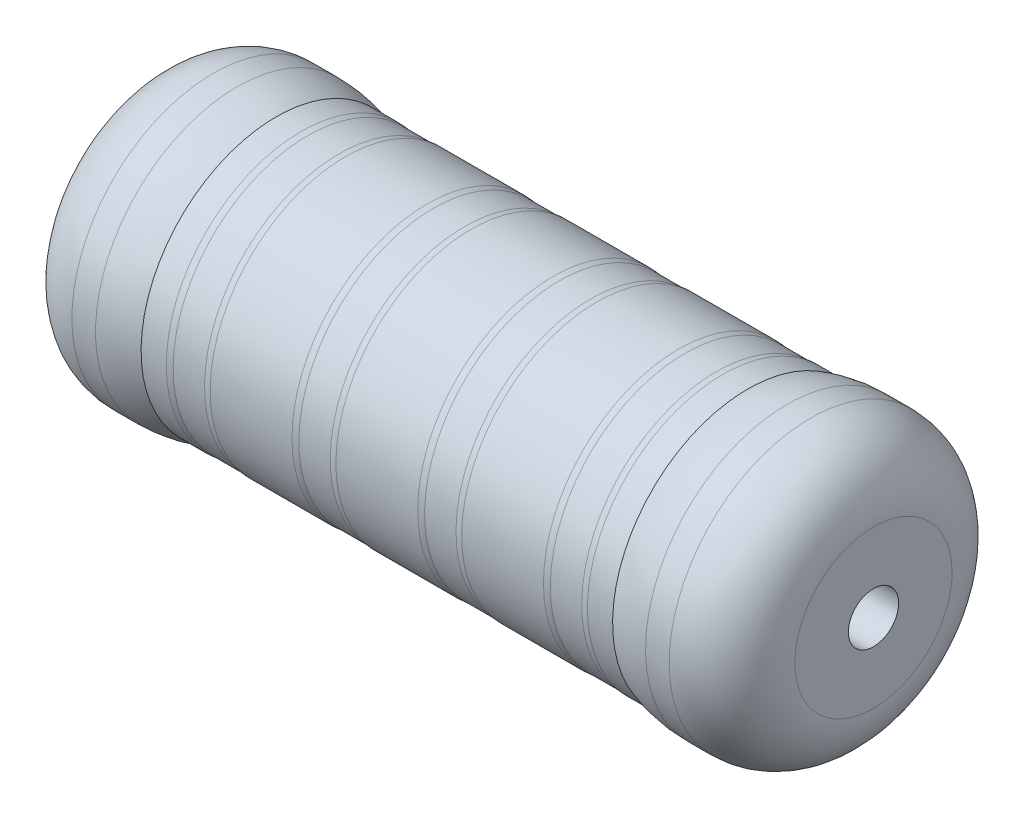
ISO-10303-21;
HEADER;
FILE_DESCRIPTION(('STEP AP214'),'2;1');
FILE_NAME('part.step','',(''),(''),'','','');
FILE_SCHEMA(('AUTOMOTIVE_DESIGN { 1 0 10303 214 1 1 1 1 }'));
ENDSEC;
DATA;
#1=APPLICATION_CONTEXT('core data for automotive mechanical design processes');
#2=APPLICATION_PROTOCOL_DEFINITION('international standard','automotive_design',2000,#1);
#3=PRODUCT_CONTEXT('',#1,'mechanical');
#4=PRODUCT('Part','Part','',(#3));
#5=PRODUCT_RELATED_PRODUCT_CATEGORY('part','',(#4));
#6=PRODUCT_DEFINITION_FORMATION('','',#4);
#7=PRODUCT_DEFINITION_CONTEXT('part definition',#1,'design');
#8=PRODUCT_DEFINITION('design','',#6,#7);
#9=PRODUCT_DEFINITION_SHAPE('','',#8);
#10=(LENGTH_UNIT() NAMED_UNIT(*) SI_UNIT(.MILLI.,.METRE.));
#11=(NAMED_UNIT(*) PLANE_ANGLE_UNIT() SI_UNIT($,.RADIAN.));
#12=(NAMED_UNIT(*) SI_UNIT($,.STERADIAN.) SOLID_ANGLE_UNIT());
#13=UNCERTAINTY_MEASURE_WITH_UNIT(LENGTH_MEASURE(1.E-05),#10,'distance_accuracy_value','');
#14=(GEOMETRIC_REPRESENTATION_CONTEXT(3) GLOBAL_UNCERTAINTY_ASSIGNED_CONTEXT((#13)) GLOBAL_UNIT_ASSIGNED_CONTEXT((#10,
#11,#12)) REPRESENTATION_CONTEXT('',''));
#15=CARTESIAN_POINT('',(0.,0.,0.));
#16=DIRECTION('',(0.,0.,1.));
#17=DIRECTION('',(1.,0.,0.));
#18=AXIS2_PLACEMENT_3D('',#15,#16,#17);
#19=CARTESIAN_POINT('',(-6.55813953488371,0.,0.));
#20=DIRECTION('',(-1.,0.,0.));
#21=DIRECTION('',(0.,-1.,0.));
#22=AXIS2_PLACEMENT_3D('',#19,#20,#21);
#23=PLANE('',#22);
#24=CARTESIAN_POINT('',(-6.55813953488371,0.,0.));
#25=DIRECTION('',(-1.,0.,0.));
#26=DIRECTION('',(0.,-1.,0.));
#27=AXIS2_PLACEMENT_3D('',#24,#25,#26);
#28=CIRCLE('',#27,0.4);
#29=CARTESIAN_POINT('',(-6.55813953488371,-0.400000000000001,0.));
#30=VERTEX_POINT('',#29);
#31=EDGE_CURVE('E143',#30,#30,#28,.T.);
#32=ORIENTED_EDGE('',*,*,#31,.F.);
#33=EDGE_LOOP('',(#32));
#34=FACE_BOUND('',#33,.T.);
#35=CARTESIAN_POINT('',(-6.55813953488371,0.,0.));
#36=DIRECTION('',(-1.,0.,0.));
#37=DIRECTION('',(0.,-1.,0.));
#38=AXIS2_PLACEMENT_3D('',#35,#36,#37);
#39=CIRCLE('',#38,1.25);
#40=CARTESIAN_POINT('',(-6.55813953488371,-1.25,0.));
#41=VERTEX_POINT('',#40);
#42=EDGE_CURVE('E91',#41,#41,#39,.T.);
#43=ORIENTED_EDGE('',*,*,#42,.T.);
#44=EDGE_LOOP('',(#43));
#45=FACE_BOUND('',#44,.T.);
#46=ADVANCED_FACE('F39',(#34,#45),#23,.T.);
#47=CARTESIAN_POINT('',(4.94186046511629,0.,0.));
#48=DIRECTION('',(-1.,0.,0.));
#49=DIRECTION('',(0.,-1.,0.));
#50=AXIS2_PLACEMENT_3D('',#47,#48,#49);
#51=PLANE('',#50);
#52=CARTESIAN_POINT('',(4.94186046511629,0.,0.));
#53=DIRECTION('',(-1.,0.,0.));
#54=DIRECTION('',(0.,-1.,0.));
#55=AXIS2_PLACEMENT_3D('',#52,#53,#54);
#56=CIRCLE('',#55,0.4);
#57=CARTESIAN_POINT('',(4.94186046511629,-0.4,0.));
#58=VERTEX_POINT('',#57);
#59=EDGE_CURVE('E43',#58,#58,#56,.T.);
#60=ORIENTED_EDGE('',*,*,#59,.T.);
#61=EDGE_LOOP('',(#60));
#62=FACE_BOUND('',#61,.T.);
#63=CARTESIAN_POINT('',(4.94186046511629,0.,0.));
#64=DIRECTION('',(-1.,0.,0.));
#65=DIRECTION('',(0.,-1.,0.));
#66=AXIS2_PLACEMENT_3D('',#63,#64,#65);
#67=CIRCLE('',#66,1.25);
#68=CARTESIAN_POINT('',(4.94186046511629,-1.25,0.));
#69=VERTEX_POINT('',#68);
#70=EDGE_CURVE('E95',#69,#69,#67,.F.);
#71=ORIENTED_EDGE('',*,*,#70,.T.);
#72=EDGE_LOOP('',(#71));
#73=FACE_BOUND('',#72,.T.);
#74=ADVANCED_FACE('F152',(#62,#73),#51,.F.);
#75=CARTESIAN_POINT('',(-6.55813953488371,0.,0.));
#76=DIRECTION('',(-1.,0.,0.));
#77=DIRECTION('',(0.,-1.,0.));
#78=AXIS2_PLACEMENT_3D('',#75,#76,#77);
#79=CYLINDRICAL_SURFACE('',#78,2.25);
#80=CARTESIAN_POINT('',(3.56636026495612,0.,0.));
#81=DIRECTION('',(-1.,0.,0.));
#82=DIRECTION('',(0.,-1.,0.));
#83=AXIS2_PLACEMENT_3D('',#80,#81,#82);
#84=CIRCLE('',#83,2.25);
#85=CARTESIAN_POINT('',(3.56636026495612,-2.25,0.));
#86=VERTEX_POINT('',#85);
#87=EDGE_CURVE('E48',#86,#86,#84,.F.);
#88=ORIENTED_EDGE('',*,*,#87,.T.);
#89=EDGE_LOOP('',(#88));
#90=FACE_BOUND('',#89,.T.);
#91=CARTESIAN_POINT('',(3.94186046511629,0.,0.));
#92=DIRECTION('',(-1.,0.,0.));
#93=DIRECTION('',(0.,-1.,0.));
#94=AXIS2_PLACEMENT_3D('',#91,#92,#93);
#95=CIRCLE('',#94,2.25);
#96=CARTESIAN_POINT('',(3.94186046511629,-2.25,0.));
#97=VERTEX_POINT('',#96);
#98=EDGE_CURVE('E99',#97,#97,#95,.T.);
#99=ORIENTED_EDGE('',*,*,#98,.T.);
#100=EDGE_LOOP('',(#99));
#101=FACE_BOUND('',#100,.T.);
#102=ADVANCED_FACE('F170',(#90,#101),#79,.T.);
#103=CARTESIAN_POINT('',(-6.55813953488371,0.,0.));
#104=DIRECTION('',(-1.,0.,0.));
#105=DIRECTION('',(0.,-1.,0.));
#106=AXIS2_PLACEMENT_3D('',#103,#104,#105);
#107=CYLINDRICAL_SURFACE('',#106,2.15);
#108=CARTESIAN_POINT('',(2.54135920882695,0.,0.));
#109=DIRECTION('',(-1.,0.,0.));
#110=DIRECTION('',(0.,-1.,0.));
#111=AXIS2_PLACEMENT_3D('',#108,#109,#110);
#112=CIRCLE('',#111,2.15);
#113=CARTESIAN_POINT('',(2.54135920882695,-2.15,0.));
#114=VERTEX_POINT('',#113);
#115=EDGE_CURVE('E75',#114,#114,#112,.F.);
#116=ORIENTED_EDGE('',*,*,#115,.T.);
#117=EDGE_LOOP('',(#116));
#118=FACE_BOUND('',#117,.T.);
#119=CARTESIAN_POINT('',(2.94186046511629,0.,0.));
#120=DIRECTION('',(-1.,0.,0.));
#121=DIRECTION('',(0.,-1.,0.));
#122=AXIS2_PLACEMENT_3D('',#119,#120,#121);
#123=CIRCLE('',#122,2.15);
#124=CARTESIAN_POINT('',(2.94186046511629,-2.15,0.));
#125=VERTEX_POINT('',#124);
#126=EDGE_CURVE('E103',#125,#125,#123,.T.);
#127=ORIENTED_EDGE('',*,*,#126,.T.);
#128=EDGE_LOOP('',(#127));
#129=FACE_BOUND('',#128,.T.);
#130=ADVANCED_FACE('F223',(#118,#129),#107,.T.);
#131=CARTESIAN_POINT('',(-6.55813953488371,0.,0.));
#132=DIRECTION('',(-1.,0.,0.));
#133=DIRECTION('',(0.,-1.,0.));
#134=AXIS2_PLACEMENT_3D('',#131,#132,#133);
#135=CYLINDRICAL_SURFACE('',#134,2.14);
#136=CARTESIAN_POINT('',(2.44186046511629,0.,0.));
#137=DIRECTION('',(-1.,0.,0.));
#138=DIRECTION('',(0.,-1.,0.));
#139=AXIS2_PLACEMENT_3D('',#136,#137,#138);
#140=CIRCLE('',#139,2.14);
#141=CARTESIAN_POINT('',(2.44186046511629,-2.14,0.));
#142=VERTEX_POINT('',#141);
#143=EDGE_CURVE('E107',#142,#142,#140,.T.);
#144=ORIENTED_EDGE('',*,*,#143,.T.);
#145=EDGE_LOOP('',(#144));
#146=FACE_BOUND('',#145,.T.);
#147=CARTESIAN_POINT('',(1.94186046511628,0.,0.));
#148=DIRECTION('',(-1.,0.,0.));
#149=DIRECTION('',(0.,-1.,0.));
#150=AXIS2_PLACEMENT_3D('',#147,#148,#149);
#151=CIRCLE('',#150,2.14);
#152=CARTESIAN_POINT('',(1.94186046511629,-2.14,0.));
#153=VERTEX_POINT('',#152);
#154=EDGE_CURVE('E111',#153,#153,#151,.T.);
#155=ORIENTED_EDGE('',*,*,#154,.F.);
#156=EDGE_LOOP('',(#155));
#157=FACE_BOUND('',#156,.T.);
#158=ADVANCED_FACE('F225',(#146,#157),#135,.T.);
#159=CARTESIAN_POINT('',(1.84236172140562,0.,0.));
#160=DIRECTION('',(1.,0.,0.));
#161=DIRECTION('',(0.,1.,0.));
#162=AXIS2_PLACEMENT_3D('',#159,#160,#161);
#163=CIRCLE('',#162,2.15);
#164=CARTESIAN_POINT('',(1.84236172140562,2.15,0.));
#165=VERTEX_POINT('',#164);
#166=EDGE_CURVE('E79',#165,#165,#163,.F.);
#167=ORIENTED_EDGE('',*,*,#166,.T.);
#168=EDGE_LOOP('',(#167));
#169=FACE_BOUND('',#168,.T.);
#170=CARTESIAN_POINT('',(0.541359208826949,0.,0.));
#171=DIRECTION('',(-1.,0.,0.));
#172=DIRECTION('',(0.,-1.,0.));
#173=AXIS2_PLACEMENT_3D('',#170,#171,#172);
#174=CIRCLE('',#173,2.15);
#175=CARTESIAN_POINT('',(0.541359208826949,-2.15,0.));
#176=VERTEX_POINT('',#175);
#177=EDGE_CURVE('E83',#176,#176,#174,.F.);
#178=ORIENTED_EDGE('',*,*,#177,.T.);
#179=EDGE_LOOP('',(#178));
#180=FACE_BOUND('',#179,.T.);
#181=ADVANCED_FACE('F228',(#169,#180),#107,.T.);
#182=CARTESIAN_POINT('',(-6.55813953488371,0.,0.));
#183=DIRECTION('',(-1.,0.,0.));
#184=DIRECTION('',(0.,-1.,0.));
#185=AXIS2_PLACEMENT_3D('',#182,#183,#184);
#186=CYLINDRICAL_SURFACE('',#185,2.14);
#187=CARTESIAN_POINT('',(0.441860465116285,0.,0.));
#188=DIRECTION('',(-1.,0.,0.));
#189=DIRECTION('',(0.,-1.,0.));
#190=AXIS2_PLACEMENT_3D('',#187,#188,#189);
#191=CIRCLE('',#190,2.14);
#192=CARTESIAN_POINT('',(0.441860465116286,-2.14,0.));
#193=VERTEX_POINT('',#192);
#194=EDGE_CURVE('E115',#193,#193,#191,.T.);
#195=ORIENTED_EDGE('',*,*,#194,.T.);
#196=EDGE_LOOP('',(#195));
#197=FACE_BOUND('',#196,.T.);
#198=CARTESIAN_POINT('',(-0.0581395348837142,0.,0.));
#199=DIRECTION('',(-1.,0.,0.));
#200=DIRECTION('',(0.,-1.,0.));
#201=AXIS2_PLACEMENT_3D('',#198,#199,#200);
#202=CIRCLE('',#201,2.14);
#203=CARTESIAN_POINT('',(-0.058139534883714,-2.14,0.));
#204=VERTEX_POINT('',#203);
#205=EDGE_CURVE('E119',#204,#204,#202,.T.);
#206=ORIENTED_EDGE('',*,*,#205,.F.);
#207=EDGE_LOOP('',(#206));
#208=FACE_BOUND('',#207,.T.);
#209=ADVANCED_FACE('F238',(#197,#208),#186,.T.);
#210=CARTESIAN_POINT('',(-6.55813953488371,0.,0.));
#211=DIRECTION('',(-1.,0.,0.));
#212=DIRECTION('',(0.,-1.,0.));
#213=AXIS2_PLACEMENT_3D('',#210,#211,#212);
#214=CYLINDRICAL_SURFACE('',#213,2.15);
#215=CARTESIAN_POINT('',(-0.157638278594376,0.,0.));
#216=DIRECTION('',(1.,0.,0.));
#217=DIRECTION('',(0.,1.,0.));
#218=AXIS2_PLACEMENT_3D('',#215,#216,#217);
#219=CIRCLE('',#218,2.15);
#220=CARTESIAN_POINT('',(-0.157638278594376,2.15,0.));
#221=VERTEX_POINT('',#220);
#222=EDGE_CURVE('E67',#221,#221,#219,.F.);
#223=ORIENTED_EDGE('',*,*,#222,.T.);
#224=EDGE_LOOP('',(#223));
#225=FACE_BOUND('',#224,.T.);
#226=CARTESIAN_POINT('',(-1.45864079117305,0.,0.));
#227=DIRECTION('',(-1.,0.,0.));
#228=DIRECTION('',(0.,-1.,0.));
#229=AXIS2_PLACEMENT_3D('',#226,#227,#228);
#230=CIRCLE('',#229,2.15);
#231=CARTESIAN_POINT('',(-1.45864079117305,-2.15,0.));
#232=VERTEX_POINT('',#231);
#233=EDGE_CURVE('E71',#232,#232,#230,.F.);
#234=ORIENTED_EDGE('',*,*,#233,.T.);
#235=EDGE_LOOP('',(#234));
#236=FACE_BOUND('',#235,.T.);
#237=ADVANCED_FACE('F243',(#225,#236),#214,.T.);
#238=CARTESIAN_POINT('',(-6.55813953488371,0.,0.));
#239=DIRECTION('',(-1.,0.,0.));
#240=DIRECTION('',(0.,-1.,0.));
#241=AXIS2_PLACEMENT_3D('',#238,#239,#240);
#242=CYLINDRICAL_SURFACE('',#241,2.14);
#243=CARTESIAN_POINT('',(-1.55813953488371,0.,0.));
#244=DIRECTION('',(-1.,0.,0.));
#245=DIRECTION('',(0.,-1.,0.));
#246=AXIS2_PLACEMENT_3D('',#243,#244,#245);
#247=CIRCLE('',#246,2.14);
#248=CARTESIAN_POINT('',(-1.55813953488371,-2.14,0.));
#249=VERTEX_POINT('',#248);
#250=EDGE_CURVE('E123',#249,#249,#247,.T.);
#251=ORIENTED_EDGE('',*,*,#250,.T.);
#252=EDGE_LOOP('',(#251));
#253=FACE_BOUND('',#252,.T.);
#254=CARTESIAN_POINT('',(-2.05813953488371,0.,0.));
#255=DIRECTION('',(-1.,0.,0.));
#256=DIRECTION('',(0.,-1.,0.));
#257=AXIS2_PLACEMENT_3D('',#254,#255,#256);
#258=CIRCLE('',#257,2.14);
#259=CARTESIAN_POINT('',(-2.05813953488371,-2.14,0.));
#260=VERTEX_POINT('',#259);
#261=EDGE_CURVE('E127',#260,#260,#258,.T.);
#262=ORIENTED_EDGE('',*,*,#261,.F.);
#263=EDGE_LOOP('',(#262));
#264=FACE_BOUND('',#263,.T.);
#265=ADVANCED_FACE('F257',(#253,#264),#242,.T.);
#266=CARTESIAN_POINT('',(-6.55813953488371,0.,0.));
#267=DIRECTION('',(-1.,0.,0.));
#268=DIRECTION('',(0.,-1.,0.));
#269=AXIS2_PLACEMENT_3D('',#266,#267,#268);
#270=CYLINDRICAL_SURFACE('',#269,2.15);
#271=CARTESIAN_POINT('',(-2.15763827859438,0.,0.));
#272=DIRECTION('',(1.,0.,0.));
#273=DIRECTION('',(0.,1.,0.));
#274=AXIS2_PLACEMENT_3D('',#271,#272,#273);
#275=CIRCLE('',#274,2.15);
#276=CARTESIAN_POINT('',(-2.15763827859438,2.15,0.));
#277=VERTEX_POINT('',#276);
#278=EDGE_CURVE('E59',#277,#277,#275,.F.);
#279=ORIENTED_EDGE('',*,*,#278,.T.);
#280=EDGE_LOOP('',(#279));
#281=FACE_BOUND('',#280,.T.);
#282=CARTESIAN_POINT('',(-3.45864079117305,0.,0.));
#283=DIRECTION('',(-1.,0.,0.));
#284=DIRECTION('',(0.,-1.,0.));
#285=AXIS2_PLACEMENT_3D('',#282,#283,#284);
#286=CIRCLE('',#285,2.15);
#287=CARTESIAN_POINT('',(-3.45864079117305,-2.15,0.));
#288=VERTEX_POINT('',#287);
#289=EDGE_CURVE('E63',#288,#288,#286,.F.);
#290=ORIENTED_EDGE('',*,*,#289,.T.);
#291=EDGE_LOOP('',(#290));
#292=FACE_BOUND('',#291,.T.);
#293=ADVANCED_FACE('F265',(#281,#292),#270,.T.);
#294=CARTESIAN_POINT('',(-6.55813953488371,0.,0.));
#295=DIRECTION('',(-1.,0.,0.));
#296=DIRECTION('',(0.,-1.,0.));
#297=AXIS2_PLACEMENT_3D('',#294,#295,#296);
#298=CYLINDRICAL_SURFACE('',#297,2.14);
#299=CARTESIAN_POINT('',(-3.55813953488371,0.,0.));
#300=DIRECTION('',(-1.,0.,0.));
#301=DIRECTION('',(0.,-1.,0.));
#302=AXIS2_PLACEMENT_3D('',#299,#300,#301);
#303=CIRCLE('',#302,2.14);
#304=CARTESIAN_POINT('',(-3.55813953488371,-2.14,0.));
#305=VERTEX_POINT('',#304);
#306=EDGE_CURVE('E131',#305,#305,#303,.T.);
#307=ORIENTED_EDGE('',*,*,#306,.T.);
#308=EDGE_LOOP('',(#307));
#309=FACE_BOUND('',#308,.T.);
#310=CARTESIAN_POINT('',(-4.05813953488371,0.,0.));
#311=DIRECTION('',(-1.,0.,0.));
#312=DIRECTION('',(0.,-1.,0.));
#313=AXIS2_PLACEMENT_3D('',#310,#311,#312);
#314=CIRCLE('',#313,2.14);
#315=CARTESIAN_POINT('',(-4.05813953488371,-2.14,0.));
#316=VERTEX_POINT('',#315);
#317=EDGE_CURVE('E135',#316,#316,#314,.T.);
#318=ORIENTED_EDGE('',*,*,#317,.F.);
#319=EDGE_LOOP('',(#318));
#320=FACE_BOUND('',#319,.T.);
#321=ADVANCED_FACE('F273',(#309,#320),#298,.T.);
#322=CARTESIAN_POINT('',(-6.55813953488371,0.,0.));
#323=DIRECTION('',(-1.,0.,0.));
#324=DIRECTION('',(0.,-1.,0.));
#325=AXIS2_PLACEMENT_3D('',#322,#323,#324);
#326=CYLINDRICAL_SURFACE('',#325,2.15);
#327=CARTESIAN_POINT('',(-4.15763827859438,0.,0.));
#328=DIRECTION('',(1.,0.,0.));
#329=DIRECTION('',(0.,1.,0.));
#330=AXIS2_PLACEMENT_3D('',#327,#328,#329);
#331=CIRCLE('',#330,2.15);
#332=CARTESIAN_POINT('',(-4.15763827859438,2.15,0.));
#333=VERTEX_POINT('',#332);
#334=EDGE_CURVE('E53',#333,#333,#331,.F.);
#335=ORIENTED_EDGE('',*,*,#334,.T.);
#336=EDGE_LOOP('',(#335));
#337=FACE_BOUND('',#336,.T.);
#338=CARTESIAN_POINT('',(-4.55813953488371,0.,0.));
#339=DIRECTION('',(-1.,0.,0.));
#340=DIRECTION('',(0.,-1.,0.));
#341=AXIS2_PLACEMENT_3D('',#338,#339,#340);
#342=CIRCLE('',#341,2.15);
#343=CARTESIAN_POINT('',(-4.55813953488371,-2.15,0.));
#344=VERTEX_POINT('',#343);
#345=EDGE_CURVE('E139',#344,#344,#342,.T.);
#346=ORIENTED_EDGE('',*,*,#345,.F.);
#347=EDGE_LOOP('',(#346));
#348=FACE_BOUND('',#347,.T.);
#349=ADVANCED_FACE('F281',(#337,#348),#326,.T.);
#350=CARTESIAN_POINT('',(-6.55813953488371,0.,0.));
#351=DIRECTION('',(-1.,0.,0.));
#352=DIRECTION('',(0.,-1.,0.));
#353=AXIS2_PLACEMENT_3D('',#350,#351,#352);
#354=CYLINDRICAL_SURFACE('',#353,2.25);
#355=CARTESIAN_POINT('',(-5.18263933472355,0.,0.));
#356=DIRECTION('',(1.,0.,0.));
#357=DIRECTION('',(0.,1.,0.));
#358=AXIS2_PLACEMENT_3D('',#355,#356,#357);
#359=CIRCLE('',#358,2.25);
#360=CARTESIAN_POINT('',(-5.18263933472355,2.25,0.));
#361=VERTEX_POINT('',#360);
#362=EDGE_CURVE('E10',#361,#361,#359,.F.);
#363=ORIENTED_EDGE('',*,*,#362,.T.);
#364=EDGE_LOOP('',(#363));
#365=FACE_BOUND('',#364,.T.);
#366=CARTESIAN_POINT('',(-5.55813953488371,0.,0.));
#367=DIRECTION('',(-1.,0.,0.));
#368=DIRECTION('',(0.,-1.,0.));
#369=AXIS2_PLACEMENT_3D('',#366,#367,#368);
#370=CIRCLE('',#369,2.25);
#371=CARTESIAN_POINT('',(-5.55813953488371,-2.25,0.));
#372=VERTEX_POINT('',#371);
#373=EDGE_CURVE('E87',#372,#372,#370,.F.);
#374=ORIENTED_EDGE('',*,*,#373,.T.);
#375=EDGE_LOOP('',(#374));
#376=FACE_BOUND('',#375,.T.);
#377=ADVANCED_FACE('F179',(#365,#376),#354,.T.);
#378=CARTESIAN_POINT('',(3.94186046511629,0.,0.));
#379=DIRECTION('',(-1.,0.,0.));
#380=DIRECTION('',(0.,-1.,0.));
#381=AXIS2_PLACEMENT_3D('',#378,#379,#380);
#382=TOROIDAL_SURFACE('',#381,1.25,1.);
#383=ORIENTED_EDGE('',*,*,#70,.F.);
#384=EDGE_LOOP('',(#383));
#385=FACE_BOUND('',#384,.T.);
#386=ORIENTED_EDGE('',*,*,#98,.F.);
#387=EDGE_LOOP('',(#386));
#388=FACE_BOUND('',#387,.T.);
#389=ADVANCED_FACE('F175',(#385,#388),#382,.T.);
#390=CARTESIAN_POINT('',(-5.55813953488371,0.,0.));
#391=DIRECTION('',(-1.,0.,0.));
#392=DIRECTION('',(0.,-1.,0.));
#393=AXIS2_PLACEMENT_3D('',#390,#391,#392);
#394=TOROIDAL_SURFACE('',#393,1.25,1.);
#395=ORIENTED_EDGE('',*,*,#373,.F.);
#396=EDGE_LOOP('',(#395));
#397=FACE_BOUND('',#396,.T.);
#398=ORIENTED_EDGE('',*,*,#42,.F.);
#399=EDGE_LOOP('',(#398));
#400=FACE_BOUND('',#399,.T.);
#401=ADVANCED_FACE('F178',(#397,#400),#394,.T.);
#402=CARTESIAN_POINT('',(1.84236172140562,0.,0.));
#403=DIRECTION('',(1.,0.,0.));
#404=DIRECTION('',(0.,1.,0.));
#405=AXIS2_PLACEMENT_3D('',#402,#403,#404);
#406=TOROIDAL_SURFACE('',#405,1.65,0.5);
#407=ORIENTED_EDGE('',*,*,#154,.T.);
#408=EDGE_LOOP('',(#407));
#409=FACE_BOUND('',#408,.T.);
#410=ORIENTED_EDGE('',*,*,#166,.F.);
#411=EDGE_LOOP('',(#410));
#412=FACE_BOUND('',#411,.T.);
#413=ADVANCED_FACE('F183',(#409,#412),#406,.T.);
#414=CARTESIAN_POINT('',(2.54135920882695,0.,0.));
#415=DIRECTION('',(-1.,0.,0.));
#416=DIRECTION('',(0.,-1.,0.));
#417=AXIS2_PLACEMENT_3D('',#414,#415,#416);
#418=TOROIDAL_SURFACE('',#417,1.65,0.5);
#419=ORIENTED_EDGE('',*,*,#115,.F.);
#420=EDGE_LOOP('',(#419));
#421=FACE_BOUND('',#420,.T.);
#422=ORIENTED_EDGE('',*,*,#143,.F.);
#423=EDGE_LOOP('',(#422));
#424=FACE_BOUND('',#423,.T.);
#425=ADVANCED_FACE('F187',(#421,#424),#418,.T.);
#426=CARTESIAN_POINT('',(0.541359208826948,0.,0.));
#427=DIRECTION('',(-1.,0.,0.));
#428=DIRECTION('',(0.,-1.,0.));
#429=AXIS2_PLACEMENT_3D('',#426,#427,#428);
#430=TOROIDAL_SURFACE('',#429,1.65,0.5);
#431=ORIENTED_EDGE('',*,*,#177,.F.);
#432=EDGE_LOOP('',(#431));
#433=FACE_BOUND('',#432,.T.);
#434=ORIENTED_EDGE('',*,*,#194,.F.);
#435=EDGE_LOOP('',(#434));
#436=FACE_BOUND('',#435,.T.);
#437=ADVANCED_FACE('F191',(#433,#436),#430,.T.);
#438=CARTESIAN_POINT('',(-0.157638278594376,0.,0.));
#439=DIRECTION('',(1.,0.,0.));
#440=DIRECTION('',(0.,1.,0.));
#441=AXIS2_PLACEMENT_3D('',#438,#439,#440);
#442=TOROIDAL_SURFACE('',#441,1.65,0.5);
#443=ORIENTED_EDGE('',*,*,#205,.T.);
#444=EDGE_LOOP('',(#443));
#445=FACE_BOUND('',#444,.T.);
#446=ORIENTED_EDGE('',*,*,#222,.F.);
#447=EDGE_LOOP('',(#446));
#448=FACE_BOUND('',#447,.T.);
#449=ADVANCED_FACE('F195',(#445,#448),#442,.T.);
#450=CARTESIAN_POINT('',(-1.45864079117305,0.,0.));
#451=DIRECTION('',(-1.,0.,0.));
#452=DIRECTION('',(0.,-1.,0.));
#453=AXIS2_PLACEMENT_3D('',#450,#451,#452);
#454=TOROIDAL_SURFACE('',#453,1.65,0.5);
#455=ORIENTED_EDGE('',*,*,#233,.F.);
#456=EDGE_LOOP('',(#455));
#457=FACE_BOUND('',#456,.T.);
#458=ORIENTED_EDGE('',*,*,#250,.F.);
#459=EDGE_LOOP('',(#458));
#460=FACE_BOUND('',#459,.T.);
#461=ADVANCED_FACE('F199',(#457,#460),#454,.T.);
#462=CARTESIAN_POINT('',(-2.15763827859438,0.,0.));
#463=DIRECTION('',(1.,0.,0.));
#464=DIRECTION('',(0.,1.,0.));
#465=AXIS2_PLACEMENT_3D('',#462,#463,#464);
#466=TOROIDAL_SURFACE('',#465,1.65,0.5);
#467=ORIENTED_EDGE('',*,*,#261,.T.);
#468=EDGE_LOOP('',(#467));
#469=FACE_BOUND('',#468,.T.);
#470=ORIENTED_EDGE('',*,*,#278,.F.);
#471=EDGE_LOOP('',(#470));
#472=FACE_BOUND('',#471,.T.);
#473=ADVANCED_FACE('F203',(#469,#472),#466,.T.);
#474=CARTESIAN_POINT('',(-3.45864079117305,0.,0.));
#475=DIRECTION('',(-1.,0.,0.));
#476=DIRECTION('',(0.,-1.,0.));
#477=AXIS2_PLACEMENT_3D('',#474,#475,#476);
#478=TOROIDAL_SURFACE('',#477,1.65,0.5);
#479=ORIENTED_EDGE('',*,*,#289,.F.);
#480=EDGE_LOOP('',(#479));
#481=FACE_BOUND('',#480,.T.);
#482=ORIENTED_EDGE('',*,*,#306,.F.);
#483=EDGE_LOOP('',(#482));
#484=FACE_BOUND('',#483,.T.);
#485=ADVANCED_FACE('F207',(#481,#484),#478,.T.);
#486=CARTESIAN_POINT('',(-4.15763827859438,0.,0.));
#487=DIRECTION('',(1.,0.,0.));
#488=DIRECTION('',(0.,1.,0.));
#489=AXIS2_PLACEMENT_3D('',#486,#487,#488);
#490=TOROIDAL_SURFACE('',#489,1.65,0.5);
#491=ORIENTED_EDGE('',*,*,#317,.T.);
#492=EDGE_LOOP('',(#491));
#493=FACE_BOUND('',#492,.T.);
#494=ORIENTED_EDGE('',*,*,#334,.F.);
#495=EDGE_LOOP('',(#494));
#496=FACE_BOUND('',#495,.T.);
#497=ADVANCED_FACE('F211',(#493,#496),#490,.T.);
#498=CARTESIAN_POINT('',(3.56636026495613,0.,0.));
#499=DIRECTION('',(-1.,0.,0.));
#500=DIRECTION('',(0.,-1.,0.));
#501=AXIS2_PLACEMENT_3D('',#498,#499,#500);
#502=DEGENERATE_TOROIDAL_SURFACE('',#501,0.25,2.,.T.);
#503=ORIENTED_EDGE('',*,*,#87,.F.);
#504=EDGE_LOOP('',(#503));
#505=FACE_BOUND('',#504,.T.);
#506=ORIENTED_EDGE('',*,*,#126,.F.);
#507=EDGE_LOOP('',(#506));
#508=FACE_BOUND('',#507,.T.);
#509=ADVANCED_FACE('F161',(#505,#508),#502,.T.);
#510=CARTESIAN_POINT('',(-5.18263933472355,0.,0.));
#511=DIRECTION('',(1.,0.,0.));
#512=DIRECTION('',(0.,1.,0.));
#513=AXIS2_PLACEMENT_3D('',#510,#511,#512);
#514=DEGENERATE_TOROIDAL_SURFACE('',#513,0.25,2.,.T.);
#515=ORIENTED_EDGE('',*,*,#345,.T.);
#516=EDGE_LOOP('',(#515));
#517=FACE_BOUND('',#516,.T.);
#518=ORIENTED_EDGE('',*,*,#362,.F.);
#519=EDGE_LOOP('',(#518));
#520=FACE_BOUND('',#519,.T.);
#521=ADVANCED_FACE('F41',(#517,#520),#514,.T.);
#522=CARTESIAN_POINT('',(9.44186046511629,0.,0.));
#523=DIRECTION('',(-1.,0.,0.));
#524=DIRECTION('',(0.,-1.,0.));
#525=AXIS2_PLACEMENT_3D('',#522,#523,#524);
#526=CYLINDRICAL_SURFACE('',#525,0.4);
#527=ORIENTED_EDGE('',*,*,#31,.T.);
#528=EDGE_LOOP('',(#527));
#529=FACE_BOUND('',#528,.T.);
#530=ORIENTED_EDGE('',*,*,#59,.F.);
#531=EDGE_LOOP('',(#530));
#532=FACE_BOUND('',#531,.T.);
#533=ADVANCED_FACE('F155',(#529,#532),#526,.F.);
#534=CLOSED_SHELL('',(#46,#74,#102,#130,#158,#181,#209,#237,#265,#293,#321,#349,#377,#389,#401,
#413,#425,#437,#449,#461,#473,#485,#497,#509,#521,#533));
#535=MANIFOLD_SOLID_BREP('B2',#534);
#536=ADVANCED_BREP_SHAPE_REPRESENTATION('',(#18,#535),#14);
#537=SHAPE_DEFINITION_REPRESENTATION(#9,#536);
ENDSEC;
END-ISO-10303-21;
